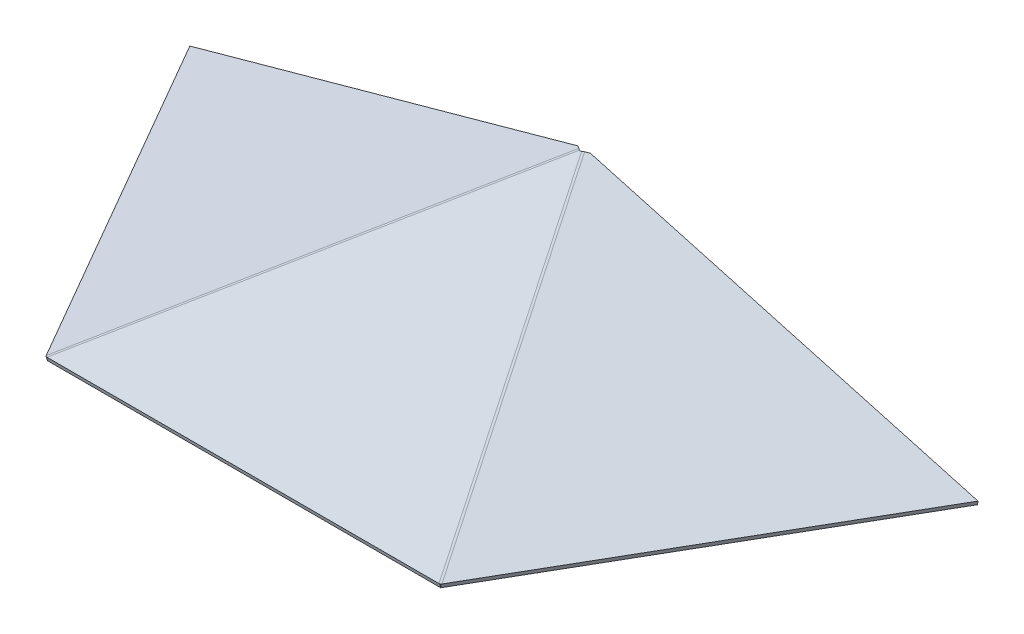
ISO-10303-21;
HEADER;
FILE_DESCRIPTION(('STEP AP214'),'2;1');
FILE_NAME('part.step','',(''),(''),'','','');
FILE_SCHEMA(('AUTOMOTIVE_DESIGN { 1 0 10303 214 1 1 1 1 }'));
ENDSEC;
DATA;
#1=APPLICATION_CONTEXT('core data for automotive mechanical design processes');
#2=APPLICATION_PROTOCOL_DEFINITION('international standard','automotive_design',2000,#1);
#3=PRODUCT_CONTEXT('',#1,'mechanical');
#4=PRODUCT('Part','Part','',(#3));
#5=PRODUCT_RELATED_PRODUCT_CATEGORY('part','',(#4));
#6=PRODUCT_DEFINITION_FORMATION('','',#4);
#7=PRODUCT_DEFINITION_CONTEXT('part definition',#1,'design');
#8=PRODUCT_DEFINITION('design','',#6,#7);
#9=PRODUCT_DEFINITION_SHAPE('','',#8);
#10=(LENGTH_UNIT() NAMED_UNIT(*) SI_UNIT(.MILLI.,.METRE.));
#11=(NAMED_UNIT(*) PLANE_ANGLE_UNIT() SI_UNIT($,.RADIAN.));
#12=(NAMED_UNIT(*) SI_UNIT($,.STERADIAN.) SOLID_ANGLE_UNIT());
#13=UNCERTAINTY_MEASURE_WITH_UNIT(LENGTH_MEASURE(1.E-05),#10,'distance_accuracy_value','');
#14=(GEOMETRIC_REPRESENTATION_CONTEXT(3) GLOBAL_UNCERTAINTY_ASSIGNED_CONTEXT((#13)) GLOBAL_UNIT_ASSIGNED_CONTEXT((#10,
#11,#12)) REPRESENTATION_CONTEXT('',''));
#15=CARTESIAN_POINT('',(0.,0.,0.));
#16=DIRECTION('',(0.,0.,1.));
#17=DIRECTION('',(1.,0.,0.));
#18=AXIS2_PLACEMENT_3D('',#15,#16,#17);
#19=CARTESIAN_POINT('',(-90.6415003255298,-327.07434132935,-58.0414148846411));
#20=DIRECTION('',(0.0406971003413713,0.1468530114833,-0.988320767282612));
#21=DIRECTION('',(0.263943522128751,0.952424147199324,0.152387863551892));
#22=AXIS2_PLACEMENT_3D('',#19,#20,#21);
#23=PLANE('',#22);
#24=DIRECTION('',(-0.963679180614625,0.267062608483341,0.));
#25=VECTOR('',#24,1.);
#26=CARTESIAN_POINT('',(10.2850944810467,37.1131379204565,0.228581795327824));
#27=LINE('',#26,#25);
#28=CARTESIAN_POINT('',(139.050448619764,1.42863622079898,0.228581795327811));
#29=VERTEX_POINT('',#28);
#30=CARTESIAN_POINT('',(2.24965773301819,39.339983473831,0.228581795327811));
#31=VERTEX_POINT('',#30);
#32=EDGE_CURVE('E226',#29,#31,#27,.T.);
#33=ORIENTED_EDGE('',*,*,#32,.F.);
#34=DIRECTION('',(0.263943522128751,0.952424147199324,0.152387863551892));
#35=VECTOR('',#34,1.);
#36=CARTESIAN_POINT('',(38.1238538131879,-362.758843029008,-58.0414148846411));
#37=LINE('',#36,#35);
#38=CARTESIAN_POINT('',(138.654533336571,0.,0.));
#39=VERTEX_POINT('',#38);
#40=EDGE_CURVE('E13',#39,#29,#37,.T.);
#41=ORIENTED_EDGE('',*,*,#40,.F.);
#42=DIRECTION('',(-0.963679180614624,0.267062608483341,0.));
#43=VECTOR('',#42,1.);
#44=CARTESIAN_POINT('',(9.88917919785359,35.6845016996575,0.));
#45=LINE('',#44,#43);
#46=CARTESIAN_POINT('',(1.85374244982505,37.9113472530321,0.));
#47=VERTEX_POINT('',#46);
#48=EDGE_CURVE('E78',#39,#47,#45,.T.);
#49=ORIENTED_EDGE('',*,*,#48,.T.);
#50=DIRECTION('',(0.263943522128751,0.952424147199324,0.152387863551892));
#51=VECTOR('',#50,1.);
#52=CARTESIAN_POINT('',(-98.6769370735583,-324.847495775976,-58.0414148846411));
#53=LINE('',#52,#51);
#54=EDGE_CURVE('E232',#47,#31,#53,.T.);
#55=ORIENTED_EDGE('',*,*,#54,.T.);
#56=EDGE_LOOP('',(#33,#41,#49,#55));
#57=FACE_BOUND('',#56,.T.);
#58=ADVANCED_FACE('F58',(#57),#23,.T.);
#59=CARTESIAN_POINT('',(-95.3192480769532,-325.43762139121,-60.1688177275612));
#60=DIRECTION('',(-0.481839590307312,0.26706260848334,-0.834570651510437));
#61=DIRECTION('',(-0.785581824913315,0.290275761973876,0.54644412191582));
#62=AXIS2_PLACEMENT_3D('',#59,#60,#61);
#63=PLANE('',#62);
#64=DIRECTION('',(-0.835562341383784,0.146853011483301,0.529405106397298));
#65=VECTOR('',#64,1.);
#66=CARTESIAN_POINT('',(5.60734672962338,38.7498578585967,-1.89882104759222));
#67=LINE('',#66,#65);
#68=CARTESIAN_POINT('',(1.02123849805244,39.5558824619545,1.00689764751258));
#69=VERTEX_POINT('',#68);
#70=EDGE_CURVE('E92',#31,#69,#67,.T.);
#71=ORIENTED_EDGE('',*,*,#70,.F.);
#72=ORIENTED_EDGE('',*,*,#54,.F.);
#73=DIRECTION('',(-0.835562341383784,0.146853011483301,0.529405106397298));
#74=VECTOR('',#73,1.);
#75=CARTESIAN_POINT('',(5.21143144643026,37.3212216377977,-2.12740284292005));
#76=LINE('',#75,#74);
#77=CARTESIAN_POINT('',(0.625323214859296,38.1272462411555,0.778315852184755));
#78=VERTEX_POINT('',#77);
#79=EDGE_CURVE('E221',#47,#78,#76,.T.);
#80=ORIENTED_EDGE('',*,*,#79,.T.);
#81=DIRECTION('',(0.263943522128751,0.952424147199324,0.152387863551892));
#82=VECTOR('',#81,1.);
#83=CARTESIAN_POINT('',(-99.9053563085241,-324.631596787852,-57.2630990324564));
#84=LINE('',#83,#82);
#85=EDGE_CURVE('E214',#78,#69,#84,.T.);
#86=ORIENTED_EDGE('',*,*,#85,.T.);
#87=EDGE_LOOP('',(#71,#72,#80,#86));
#88=FACE_BOUND('',#87,.T.);
#89=ADVANCED_FACE('F220',(#88),#63,.T.);
#90=CARTESIAN_POINT('',(10.0554473588905,36.2844702467344,5.80551523947748));
#91=DIRECTION('',(-0.263943522128751,-0.952424147199324,-0.152387863551892));
#92=DIRECTION('',(0.963679180614624,-0.267062608483341,0.));
#93=AXIS2_PLACEMENT_3D('',#90,#91,#92);
#94=PLANE('',#93);
#95=ORIENTED_EDGE('',*,*,#70,.T.);
#96=DIRECTION('',(0.481839590307312,-0.26706260848334,0.834570651510437));
#97=VECTOR('',#96,1.);
#98=CARTESIAN_POINT('',(1.02123849805238,39.5558824619544,1.00689764751253));
#99=LINE('',#98,#97);
#100=CARTESIAN_POINT('',(69.8111631255219,1.42863622079898,120.154542151123));
#101=VERTEX_POINT('',#100);
#102=EDGE_CURVE('E201',#69,#101,#99,.T.);
#103=ORIENTED_EDGE('',*,*,#102,.T.);
#104=DIRECTION('',(0.499999999999998,0.,-0.86602540378444));
#105=VECTOR('',#104,1.);
#106=CARTESIAN_POINT('',(104.386815285622,1.42863622079894,60.2677559050012));
#107=LINE('',#106,#105);
#108=EDGE_CURVE('E208',#101,#29,#107,.T.);
#109=ORIENTED_EDGE('',*,*,#108,.T.);
#110=ORIENTED_EDGE('',*,*,#32,.T.);
#111=EDGE_LOOP('',(#95,#103,#109,#110));
#112=FACE_BOUND('',#111,.T.);
#113=ADVANCED_FACE('F224',(#112),#94,.F.);
#114=CARTESIAN_POINT('',(3.46022047904538,-362.758843029008,1.99775922503227));
#115=DIRECTION('',(0.824823506652345,-0.304775727103784,0.47621207359966));
#116=DIRECTION('',(0.41383501697767,-0.248451741891321,-0.875792390166905));
#117=AXIS2_PLACEMENT_3D('',#114,#115,#116);
#118=PLANE('',#117);
#119=ORIENTED_EDGE('',*,*,#108,.F.);
#120=DIRECTION('',(0.263943522128751,0.952424147199324,0.152387863551892));
#121=VECTOR('',#120,1.);
#122=CARTESIAN_POINT('',(-31.1154316810546,-362.758843029008,61.8845454711544));
#123=LINE('',#122,#121);
#124=CARTESIAN_POINT('',(69.4152478423287,0.,119.925960355795));
#125=VERTEX_POINT('',#124);
#126=EDGE_CURVE('E235',#125,#101,#123,.T.);
#127=ORIENTED_EDGE('',*,*,#126,.F.);
#128=DIRECTION('',(0.499999999999998,0.,-0.86602540378444));
#129=VECTOR('',#128,1.);
#130=CARTESIAN_POINT('',(103.990900002429,0.,60.0391741096734));
#131=LINE('',#130,#129);
#132=EDGE_CURVE('E69',#125,#39,#131,.T.);
#133=ORIENTED_EDGE('',*,*,#132,.T.);
#134=ORIENTED_EDGE('',*,*,#40,.T.);
#135=EDGE_LOOP('',(#119,#127,#133,#134));
#136=FACE_BOUND('',#135,.T.);
#137=ADVANCED_FACE('F252',(#136),#118,.T.);
#138=CARTESIAN_POINT('',(9.65953207569734,34.8558340259354,5.57693344414965));
#139=DIRECTION('',(-0.263943522128751,-0.952424147199324,-0.152387863551892));
#140=DIRECTION('',(0.963679180614624,-0.267062608483341,0.));
#141=AXIS2_PLACEMENT_3D('',#138,#139,#140);
#142=PLANE('',#141);
#143=DIRECTION('',(0.481839590307312,-0.26706260848334,0.834570651510437));
#144=VECTOR('',#143,1.);
#145=CARTESIAN_POINT('',(0.625323214859275,38.1272462411555,0.778315852184692));
#146=LINE('',#145,#144);
#147=EDGE_CURVE('E239',#78,#125,#146,.T.);
#148=ORIENTED_EDGE('',*,*,#147,.F.);
#149=ORIENTED_EDGE('',*,*,#79,.F.);
#150=ORIENTED_EDGE('',*,*,#48,.F.);
#151=ORIENTED_EDGE('',*,*,#132,.F.);
#152=EDGE_LOOP('',(#148,#149,#150,#151));
#153=FACE_BOUND('',#152,.T.);
#154=ADVANCED_FACE('F60',(#153),#142,.T.);
#155=CARTESIAN_POINT('',(90.6415003255299,-327.07434132935,-58.0414148846411));
#156=DIRECTION('',(0.0406971003413715,-0.1468530114833,0.988320767282612));
#157=DIRECTION('',(0.263943522128751,-0.952424147199324,-0.152387863551891));
#158=AXIS2_PLACEMENT_3D('',#155,#156,#157);
#159=PLANE('',#158);
#160=DIRECTION('',(-0.263943522128751,0.952424147199324,0.152387863551891));
#161=VECTOR('',#160,1.);
#162=CARTESIAN_POINT('',(-38.1238538131877,-362.758843029008,-58.0414148846411));
#163=LINE('',#162,#161);
#164=CARTESIAN_POINT('',(-138.654533336571,0.,0.));
#165=VERTEX_POINT('',#164);
#166=CARTESIAN_POINT('',(-139.050448619764,1.42863622079894,0.228581795327811));
#167=VERTEX_POINT('',#166);
#168=EDGE_CURVE('E539',#165,#167,#163,.T.);
#169=ORIENTED_EDGE('',*,*,#168,.T.);
#170=DIRECTION('',(0.963679180614625,0.267062608483341,0.));
#171=VECTOR('',#170,1.);
#172=CARTESIAN_POINT('',(-10.2850944810467,37.1131379204564,0.228581795327824));
#173=LINE('',#172,#171);
#174=CARTESIAN_POINT('',(-2.24965773301817,39.3399834738311,0.228581795327832));
#175=VERTEX_POINT('',#174);
#176=EDGE_CURVE('E540',#167,#175,#173,.T.);
#177=ORIENTED_EDGE('',*,*,#176,.T.);
#178=DIRECTION('',(-0.263943522128751,0.952424147199324,0.152387863551891));
#179=VECTOR('',#178,1.);
#180=CARTESIAN_POINT('',(98.6769370735585,-324.847495775976,-58.0414148846411));
#181=LINE('',#180,#179);
#182=CARTESIAN_POINT('',(-1.853742449825,37.9113472530321,0.));
#183=VERTEX_POINT('',#182);
#184=EDGE_CURVE('E819',#183,#175,#181,.T.);
#185=ORIENTED_EDGE('',*,*,#184,.F.);
#186=DIRECTION('',(0.963679180614624,0.267062608483341,0.));
#187=VECTOR('',#186,1.);
#188=CARTESIAN_POINT('',(-9.88917919785358,35.6845016996575,0.));
#189=LINE('',#188,#187);
#190=EDGE_CURVE('E110',#165,#183,#189,.T.);
#191=ORIENTED_EDGE('',*,*,#190,.F.);
#192=EDGE_LOOP('',(#169,#177,#185,#191));
#193=FACE_BOUND('',#192,.T.);
#194=ADVANCED_FACE('F575',(#193),#159,.F.);
#195=CARTESIAN_POINT('',(-3.46022047904522,-362.758843029008,1.99775922503224));
#196=DIRECTION('',(-0.824823506652346,-0.304775727103784,0.47621207359966));
#197=DIRECTION('',(0.41383501697767,0.24845174189132,0.875792390166905));
#198=AXIS2_PLACEMENT_3D('',#195,#196,#197);
#199=PLANE('',#198);
#200=DIRECTION('',(0.499999999999998,0.,0.86602540378444));
#201=VECTOR('',#200,1.);
#202=CARTESIAN_POINT('',(-104.386815285622,1.42863622079894,60.2677559050011));
#203=LINE('',#202,#201);
#204=CARTESIAN_POINT('',(-69.8111631255217,1.428636220799,120.154542151123));
#205=VERTEX_POINT('',#204);
#206=EDGE_CURVE('E125',#167,#205,#203,.T.);
#207=ORIENTED_EDGE('',*,*,#206,.F.);
#208=ORIENTED_EDGE('',*,*,#168,.F.);
#209=DIRECTION('',(0.499999999999997,0.,0.86602540378444));
#210=VECTOR('',#209,1.);
#211=CARTESIAN_POINT('',(-103.990900002429,0.,60.0391741096733));
#212=LINE('',#211,#210);
#213=CARTESIAN_POINT('',(-69.4152478423286,0.,119.925960355795));
#214=VERTEX_POINT('',#213);
#215=EDGE_CURVE('E521',#165,#214,#212,.T.);
#216=ORIENTED_EDGE('',*,*,#215,.T.);
#217=DIRECTION('',(-0.263943522128751,0.952424147199324,0.152387863551891));
#218=VECTOR('',#217,1.);
#219=CARTESIAN_POINT('',(31.1154316810548,-362.758843029008,61.8845454711545));
#220=LINE('',#219,#218);
#221=EDGE_CURVE('E505',#214,#205,#220,.T.);
#222=ORIENTED_EDGE('',*,*,#221,.T.);
#223=EDGE_LOOP('',(#207,#208,#216,#222));
#224=FACE_BOUND('',#223,.T.);
#225=ADVANCED_FACE('F538',(#224),#199,.T.);
#226=CARTESIAN_POINT('',(-10.0554473588904,36.2844702467344,5.8055152394775));
#227=DIRECTION('',(0.263943522128751,-0.952424147199324,-0.152387863551891));
#228=DIRECTION('',(0.963679180614624,0.267062608483341,0.));
#229=AXIS2_PLACEMENT_3D('',#226,#227,#228);
#230=PLANE('',#229);
#231=ORIENTED_EDGE('',*,*,#206,.T.);
#232=DIRECTION('',(0.481839590307312,0.26706260848334,-0.834570651510438));
#233=VECTOR('',#232,1.);
#234=CARTESIAN_POINT('',(-69.8111631255218,1.42863622079892,120.154542151123));
#235=LINE('',#234,#233);
#236=CARTESIAN_POINT('',(-1.02123849805232,39.5558824619545,1.00689764751255));
#237=VERTEX_POINT('',#236);
#238=EDGE_CURVE('E554',#205,#237,#235,.T.);
#239=ORIENTED_EDGE('',*,*,#238,.T.);
#240=DIRECTION('',(-0.835562341383784,-0.146853011483302,-0.529405106397298));
#241=VECTOR('',#240,1.);
#242=CARTESIAN_POINT('',(-5.60734672962335,38.7498578585967,-1.89882104759224));
#243=LINE('',#242,#241);
#244=EDGE_CURVE('E546',#237,#175,#243,.T.);
#245=ORIENTED_EDGE('',*,*,#244,.T.);
#246=ORIENTED_EDGE('',*,*,#176,.F.);
#247=EDGE_LOOP('',(#231,#239,#245,#246));
#248=FACE_BOUND('',#247,.T.);
#249=ADVANCED_FACE('F574',(#248),#230,.F.);
#250=CARTESIAN_POINT('',(95.3192480769533,-325.43762139121,-60.1688177275611));
#251=DIRECTION('',(0.481839590307312,0.26706260848334,-0.834570651510438));
#252=DIRECTION('',(-0.785581824913315,-0.290275761973876,-0.54644412191582));
#253=AXIS2_PLACEMENT_3D('',#250,#251,#252);
#254=PLANE('',#253);
#255=ORIENTED_EDGE('',*,*,#244,.F.);
#256=DIRECTION('',(-0.263943522128751,0.952424147199324,0.152387863551891));
#257=VECTOR('',#256,1.);
#258=CARTESIAN_POINT('',(99.9053563085243,-324.631596787852,-57.2630990324564));
#259=LINE('',#258,#257);
#260=CARTESIAN_POINT('',(-0.62532321485917,38.1272462411555,0.778315852184653));
#261=VERTEX_POINT('',#260);
#262=EDGE_CURVE('E537',#261,#237,#259,.T.);
#263=ORIENTED_EDGE('',*,*,#262,.F.);
#264=DIRECTION('',(-0.835562341383784,-0.146853011483302,-0.529405106397298));
#265=VECTOR('',#264,1.);
#266=CARTESIAN_POINT('',(-5.21143144643021,37.3212216377977,-2.12740284292008));
#267=LINE('',#266,#265);
#268=EDGE_CURVE('E535',#261,#183,#267,.T.);
#269=ORIENTED_EDGE('',*,*,#268,.T.);
#270=ORIENTED_EDGE('',*,*,#184,.T.);
#271=EDGE_LOOP('',(#255,#263,#269,#270));
#272=FACE_BOUND('',#271,.T.);
#273=ADVANCED_FACE('F578',(#272),#254,.T.);
#274=CARTESIAN_POINT('',(-9.65953207569732,34.8558340259354,5.57693344414966));
#275=DIRECTION('',(0.263943522128751,-0.952424147199324,-0.152387863551891));
#276=DIRECTION('',(0.963679180614624,0.267062608483341,0.));
#277=AXIS2_PLACEMENT_3D('',#274,#275,#276);
#278=PLANE('',#277);
#279=DIRECTION('',(0.481839590307312,0.26706260848334,-0.834570651510438));
#280=VECTOR('',#279,1.);
#281=CARTESIAN_POINT('',(-69.4152478423286,0.,119.925960355796));
#282=LINE('',#281,#280);
#283=EDGE_CURVE('E440',#214,#261,#282,.T.);
#284=ORIENTED_EDGE('',*,*,#283,.F.);
#285=ORIENTED_EDGE('',*,*,#215,.F.);
#286=ORIENTED_EDGE('',*,*,#190,.T.);
#287=ORIENTED_EDGE('',*,*,#268,.F.);
#288=EDGE_LOOP('',(#284,#285,#286,#287));
#289=FACE_BOUND('',#288,.T.);
#290=ADVANCED_FACE('F534',(#289),#278,.T.);
#291=CARTESIAN_POINT('',(-4.44810062926708,-317.908520930581,-110.223987020652));
#292=DIRECTION('',(-0.481839590307312,0.26706260848334,-0.834570651510437));
#293=DIRECTION('',(-0.866025403784439,0.,0.5));
#294=AXIS2_PLACEMENT_3D('',#291,#292,#293);
#295=PLANE('',#294);
#296=DIRECTION('',(-0.876259441725156,-0.1468530114833,0.458915660885313));
#297=VECTOR('',#296,1.);
#298=CARTESIAN_POINT('',(-4.44810062926709,38.7498578585967,3.90669419188531));
#299=LINE('',#298,#297);
#300=CARTESIAN_POINT('',(0.36137969273054,39.5558824619544,1.38786730639224));
#301=VERTEX_POINT('',#300);
#302=CARTESIAN_POINT('',(0.,39.4953185540073,1.57712951872679));
#303=VERTEX_POINT('',#302);
#304=EDGE_CURVE('E140',#301,#303,#299,.T.);
#305=ORIENTED_EDGE('',*,*,#304,.F.);
#306=DIRECTION('',(0.,0.952424147199324,0.304775727103784));
#307=VECTOR('',#306,1.);
#308=CARTESIAN_POINT('',(0.361379692730548,-317.102496327223,-112.742813906145));
#309=LINE('',#308,#307);
#310=CARTESIAN_POINT('',(0.361379692730544,38.1272462411555,0.930703715736583));
#311=VERTEX_POINT('',#310);
#312=EDGE_CURVE('E216',#311,#301,#309,.T.);
#313=ORIENTED_EDGE('',*,*,#312,.F.);
#314=DIRECTION('',(-0.876259441725156,-0.1468530114833,0.458915660885313));
#315=VECTOR('',#314,1.);
#316=CARTESIAN_POINT('',(-4.44810062926709,37.3212216377977,3.44953060122963));
#317=LINE('',#316,#315);
#318=CARTESIAN_POINT('',(0.,38.0666823332084,1.11996592807115));
#319=VERTEX_POINT('',#318);
#320=EDGE_CURVE('E372',#311,#319,#317,.T.);
#321=ORIENTED_EDGE('',*,*,#320,.T.);
#322=DIRECTION('',(0.,0.952424147199324,0.304775727103784));
#323=VECTOR('',#322,1.);
#324=CARTESIAN_POINT('',(0.,-317.16306023517,-112.55355169381));
#325=LINE('',#324,#323);
#326=EDGE_CURVE('E388',#319,#303,#325,.T.);
#327=ORIENTED_EDGE('',*,*,#326,.T.);
#328=EDGE_LOOP('',(#305,#313,#321,#327));
#329=FACE_BOUND('',#328,.T.);
#330=ADVANCED_FACE('F411',(#329),#295,.T.);
#331=CARTESIAN_POINT('',(0.,-355.229742568379,6.4048305974663));
#332=DIRECTION('',(0.,-0.304775727103784,0.952424147199324));
#333=DIRECTION('',(0.,-0.952424147199324,-0.304775727103784));
#334=AXIS2_PLACEMENT_3D('',#331,#332,#333);
#335=PLANE('',#334);
#336=DIRECTION('',(1.,0.,0.));
#337=VECTOR('',#336,1.);
#338=CARTESIAN_POINT('',(0.,1.42863622079897,120.535511810003));
#339=LINE('',#338,#337);
#340=CARTESIAN_POINT('',(-69.1513043201999,1.42863622079895,120.535511810003));
#341=VERTEX_POINT('',#340);
#342=CARTESIAN_POINT('',(69.1513043202001,1.42863622079901,120.535511810003));
#343=VERTEX_POINT('',#342);
#344=EDGE_CURVE('E369',#341,#343,#339,.T.);
#345=ORIENTED_EDGE('',*,*,#344,.F.);
#346=DIRECTION('',(0.,0.952424147199324,0.304775727103784));
#347=VECTOR('',#346,1.);
#348=CARTESIAN_POINT('',(-69.1513043201999,-355.229742568379,6.4048305974663));
#349=LINE('',#348,#347);
#350=CARTESIAN_POINT('',(-69.1513043201999,0.,120.078348219347));
#351=VERTEX_POINT('',#350);
#352=EDGE_CURVE('E383',#351,#341,#349,.T.);
#353=ORIENTED_EDGE('',*,*,#352,.F.);
#354=DIRECTION('',(1.,0.,0.));
#355=VECTOR('',#354,1.);
#356=CARTESIAN_POINT('',(0.,0.,120.078348219347));
#357=LINE('',#356,#355);
#358=CARTESIAN_POINT('',(69.1513043202,0.,120.078348219347));
#359=VERTEX_POINT('',#358);
#360=EDGE_CURVE('E433',#351,#359,#357,.T.);
#361=ORIENTED_EDGE('',*,*,#360,.T.);
#362=DIRECTION('',(0.,0.952424147199324,0.304775727103784));
#363=VECTOR('',#362,1.);
#364=CARTESIAN_POINT('',(69.1513043202,-355.229742568379,6.4048305974663));
#365=LINE('',#364,#363);
#366=EDGE_CURVE('E346',#359,#343,#365,.T.);
#367=ORIENTED_EDGE('',*,*,#366,.T.);
#368=EDGE_LOOP('',(#345,#353,#361,#367));
#369=FACE_BOUND('',#368,.T.);
#370=ADVANCED_FACE('F400',(#369),#335,.T.);
#371=CARTESIAN_POINT('',(4.44810062926711,-317.908520930581,-110.223987020652));
#372=DIRECTION('',(0.481839590307312,0.26706260848334,-0.834570651510437));
#373=DIRECTION('',(-0.866025403784439,0.,-0.5));
#374=AXIS2_PLACEMENT_3D('',#371,#372,#373);
#375=PLANE('',#374);
#376=DIRECTION('',(-0.876259441725156,0.1468530114833,-0.458915660885313));
#377=VECTOR('',#376,1.);
#378=CARTESIAN_POINT('',(4.4481006292671,38.7498578585967,3.90669419188529));
#379=LINE('',#378,#377);
#380=CARTESIAN_POINT('',(-0.361379692730448,39.5558824619545,1.38786730639228));
#381=VERTEX_POINT('',#380);
#382=EDGE_CURVE('E148',#303,#381,#379,.T.);
#383=ORIENTED_EDGE('',*,*,#382,.F.);
#384=ORIENTED_EDGE('',*,*,#326,.F.);
#385=DIRECTION('',(-0.876259441725156,0.1468530114833,-0.458915660885313));
#386=VECTOR('',#385,1.);
#387=CARTESIAN_POINT('',(4.4481006292671,37.3212216377977,3.44953060122961));
#388=LINE('',#387,#386);
#389=CARTESIAN_POINT('',(-0.361379692730373,38.1272462411555,0.930703715736429));
#390=VERTEX_POINT('',#389);
#391=EDGE_CURVE('E368',#319,#390,#388,.T.);
#392=ORIENTED_EDGE('',*,*,#391,.T.);
#393=DIRECTION('',(0.,0.952424147199324,0.304775727103784));
#394=VECTOR('',#393,1.);
#395=CARTESIAN_POINT('',(-0.361379692730437,-317.102496327223,-112.742813906145));
#396=LINE('',#395,#394);
#397=EDGE_CURVE('E427',#390,#381,#396,.T.);
#398=ORIENTED_EDGE('',*,*,#397,.T.);
#399=EDGE_LOOP('',(#383,#384,#392,#398));
#400=FACE_BOUND('',#399,.T.);
#401=ADVANCED_FACE('F410',(#400),#375,.T.);
#402=CARTESIAN_POINT('',(0.,34.8558340259354,11.1538668882993));
#403=DIRECTION('',(0.,-0.952424147199324,-0.304775727103784));
#404=DIRECTION('',(0.,0.304775727103784,-0.952424147199324));
#405=AXIS2_PLACEMENT_3D('',#402,#403,#404);
#406=PLANE('',#405);
#407=ORIENTED_EDGE('',*,*,#320,.F.);
#408=DIRECTION('',(0.481839590307312,-0.26706260848334,0.834570651510438));
#409=VECTOR('',#408,1.);
#410=CARTESIAN_POINT('',(0.361379692730539,38.1272462411555,0.930703715736572));
#411=LINE('',#410,#409);
#412=EDGE_CURVE('E386',#311,#359,#411,.T.);
#413=ORIENTED_EDGE('',*,*,#412,.T.);
#414=ORIENTED_EDGE('',*,*,#360,.F.);
#415=DIRECTION('',(0.481839590307312,0.26706260848334,-0.834570651510438));
#416=VECTOR('',#415,1.);
#417=CARTESIAN_POINT('',(-69.1513043201999,0.,120.078348219348));
#418=LINE('',#417,#416);
#419=EDGE_CURVE('E389',#351,#390,#418,.T.);
#420=ORIENTED_EDGE('',*,*,#419,.T.);
#421=ORIENTED_EDGE('',*,*,#391,.F.);
#422=EDGE_LOOP('',(#407,#413,#414,#420,#421));
#423=FACE_BOUND('',#422,.T.);
#424=ADVANCED_FACE('F603',(#423),#406,.T.);
#425=CARTESIAN_POINT('',(0.,36.2844702467344,11.611030478955));
#426=DIRECTION('',(0.,-0.952424147199324,-0.304775727103784));
#427=DIRECTION('',(0.,0.304775727103784,-0.952424147199324));
#428=AXIS2_PLACEMENT_3D('',#425,#426,#427);
#429=PLANE('',#428);
#430=DIRECTION('',(0.481839590307312,-0.26706260848334,0.834570651510438));
#431=VECTOR('',#430,1.);
#432=CARTESIAN_POINT('',(0.361379692730539,39.5558824619544,1.38786730639223));
#433=LINE('',#432,#431);
#434=EDGE_CURVE('E365',#301,#343,#433,.T.);
#435=ORIENTED_EDGE('',*,*,#434,.F.);
#436=ORIENTED_EDGE('',*,*,#304,.T.);
#437=ORIENTED_EDGE('',*,*,#382,.T.);
#438=DIRECTION('',(0.481839590307312,0.26706260848334,-0.834570651510438));
#439=VECTOR('',#438,1.);
#440=CARTESIAN_POINT('',(-69.1513043201999,1.42863622079897,120.535511810003));
#441=LINE('',#440,#439);
#442=EDGE_CURVE('E374',#341,#381,#441,.T.);
#443=ORIENTED_EDGE('',*,*,#442,.F.);
#444=ORIENTED_EDGE('',*,*,#344,.T.);
#445=EDGE_LOOP('',(#435,#436,#437,#443,#444));
#446=FACE_BOUND('',#445,.T.);
#447=ADVANCED_FACE('F708',(#446),#429,.F.);
#448=CARTESIAN_POINT('',(-0.361379692730424,37.1748220939561,0.625927988632757));
#449=DIRECTION('',(0.481839590307318,0.267062608483339,-0.834570651510434));
#450=DIRECTION('',(-0.866025403784435,0.,-0.500000000000006));
#451=AXIS2_PLACEMENT_3D('',#448,#449,#450);
#452=PLANE('',#451);
#453=ORIENTED_EDGE('',*,*,#397,.F.);
#454=CARTESIAN_POINT('',(-0.361379692730368,37.1748220939562,0.625927988632646));
#455=DIRECTION('',(0.481839590307312,0.26706260848334,-0.834570651510438));
#456=DIRECTION('',(-0.866025403784439,0.,-0.499999999999999));
#457=AXIS2_PLACEMENT_3D('',#454,#455,#456);
#458=CIRCLE('',#457,1.00000000000001);
#459=EDGE_CURVE('E532',#390,#261,#458,.F.);
#460=ORIENTED_EDGE('',*,*,#459,.T.);
#461=ORIENTED_EDGE('',*,*,#262,.T.);
#462=CARTESIAN_POINT('',(-0.361379692730368,37.1748220939562,0.625927988632646));
#463=DIRECTION('',(0.481839590307312,0.26706260848334,-0.834570651510438));
#464=DIRECTION('',(-0.866025403784439,0.,-0.499999999999999));
#465=AXIS2_PLACEMENT_3D('',#462,#463,#464);
#466=CIRCLE('',#465,2.50000000000001);
#467=EDGE_CURVE('E132',#381,#237,#466,.F.);
#468=ORIENTED_EDGE('',*,*,#467,.F.);
#469=EDGE_LOOP('',(#453,#460,#461,#468));
#470=FACE_BOUND('',#469,.T.);
#471=ADVANCED_FACE('F714',(#470),#452,.T.);
#472=CARTESIAN_POINT('',(-69.8111631255217,1.42863622079898,120.154542151123));
#473=CARTESIAN_POINT('',(-69.7282837092607,1.43425283742235,120.262989657093));
#474=CARTESIAN_POINT('',(-69.6428299449391,1.43056348513933,120.369943048303));
#475=CARTESIAN_POINT('',(-69.5560668416055,1.41745804635144,120.474641744318));
#476=CARTESIAN_POINT('',(-69.4152478423286,0.,119.925960355796));
#477=CARTESIAN_POINT('',(-69.3962832362947,-0.00561658498654571,119.993911673158));
#478=CARTESIAN_POINT('',(-69.3762879573557,-0.0149553596019049,120.06126543747));
#479=CARTESIAN_POINT('',(-69.355769885243,-0.0280607245704963,120.127717239297));
#480=B_SPLINE_SURFACE_WITH_KNOTS('',1,3,((#472,#473,#474,#475),(#476,#477,#478,#479)),
.UNSPECIFIED.,.F.,.F.,.F.,(2,2),(4,4),(0.,1.),(0.,1.),.UNSPECIFIED.);
#481=CARTESIAN_POINT('',(-69.4152478423286,0.,119.925960355796));
#482=CARTESIAN_POINT('',(-69.3962832362947,-0.00561658498654571,119.993911673158));
#483=CARTESIAN_POINT('',(-69.3762879573557,-0.0149553596019049,120.06126543747));
#484=CARTESIAN_POINT('',(-69.355769885243,-0.0280607245704963,120.127717239297));
#485=B_SPLINE_CURVE_WITH_KNOTS('',3,(#481,#482,#483,#484),.UNSPECIFIED.,.F.,.F.,(4,4),(0.,1.),.UNSPECIFIED.);
#486=CARTESIAN_POINT('',(-69.355769885243,-0.0280607245704825,120.127717239297));
#487=VERTEX_POINT('',#486);
#488=EDGE_CURVE('E514',#214,#487,#485,.T.);
#489=CARTESIAN_POINT('',(-69.355769885243,-0.0280607245704963,120.127717239297));
#490=CARTESIAN_POINT('',(-69.5560668416055,1.41745804635144,120.474641744318));
#491=B_SPLINE_CURVE_WITH_KNOTS('',1,(#489,#490),.UNSPECIFIED.,.F.,.F.,(2,2),(0.,1.),.UNSPECIFIED.);
#492=CARTESIAN_POINT('',(-69.5560672836203,1.41745811311705,120.47464121093));
#493=VERTEX_POINT('',#492);
#494=EDGE_CURVE('E447',#487,#493,#491,.T.);
#495=CARTESIAN_POINT('',(-69.5560668416055,1.41745804635144,120.474641744318));
#496=CARTESIAN_POINT('',(-69.6428299449391,1.43056348513933,120.369943048303));
#497=CARTESIAN_POINT('',(-69.7282837092607,1.43425283742235,120.262989657093));
#498=CARTESIAN_POINT('',(-69.8111631255217,1.42863622079898,120.154542151123));
#499=B_SPLINE_CURVE_WITH_KNOTS('',3,(#495,#496,#497,#498),.UNSPECIFIED.,.F.,.F.,(4,4),(0.,1.),.UNSPECIFIED.);
#500=EDGE_CURVE('E517',#205,#493,#499,.F.);
#501=ORIENTED_EDGE('',*,*,#221,.F.);
#502=ORIENTED_EDGE('',*,*,#488,.T.);
#503=ORIENTED_EDGE('',*,*,#494,.T.);
#504=ORIENTED_EDGE('',*,*,#500,.F.);
#505=EDGE_LOOP('',(#501,#502,#503,#504));
#506=FACE_BOUND('',#505,.T.);
#507=ADVANCED_FACE('F466',(#506),#480,.T.);
#508=CARTESIAN_POINT('',(-69.5560668416055,1.41745804635144,120.474641744318));
#509=CARTESIAN_POINT('',(-69.4220135594466,1.43056348513932,120.497431447909));
#510=CARTESIAN_POINT('',(-69.2866623234773,1.43425283742233,120.517959883055));
#511=CARTESIAN_POINT('',(-69.1513043201999,1.42863622079895,120.535511810003));
#512=CARTESIAN_POINT('',(-69.355769885243,-0.0280607245704963,120.127717239297));
#513=CARTESIAN_POINT('',(-69.2879619006778,-0.0149553596019455,120.11226051007));
#514=CARTESIAN_POINT('',(-69.2196341902729,-0.00561658498655543,120.09590004743));
#515=CARTESIAN_POINT('',(-69.1513043201999,0.,120.078348219347));
#516=B_SPLINE_SURFACE_WITH_KNOTS('',1,3,((#508,#509,#510,#511),(#512,#513,#514,#515)),
.UNSPECIFIED.,.F.,.F.,.F.,(2,2),(4,4),(0.,1.),(0.,1.),.UNSPECIFIED.);
#517=CARTESIAN_POINT('',(-69.355769885243,-0.0280607245704963,120.127717239297));
#518=CARTESIAN_POINT('',(-69.2879619006778,-0.0149553596019455,120.11226051007));
#519=CARTESIAN_POINT('',(-69.2196341902729,-0.00561658498655543,120.09590004743));
#520=CARTESIAN_POINT('',(-69.1513043201999,0.,120.078348219347));
#521=B_SPLINE_CURVE_WITH_KNOTS('',3,(#517,#518,#519,#520),.UNSPECIFIED.,.F.,.F.,(4,4),(0.,1.),.UNSPECIFIED.);
#522=EDGE_CURVE('E530',#487,#351,#521,.T.);
#523=CARTESIAN_POINT('',(-69.1513043201999,1.42863622079895,120.535511810003));
#524=CARTESIAN_POINT('',(-69.2866623234773,1.43425283742233,120.517959883055));
#525=CARTESIAN_POINT('',(-69.4220135594466,1.43056348513932,120.497431447909));
#526=CARTESIAN_POINT('',(-69.5560668416055,1.41745804635144,120.474641744318));
#527=B_SPLINE_CURVE_WITH_KNOTS('',3,(#523,#524,#525,#526),.UNSPECIFIED.,.F.,.F.,(4,4),(0.,1.),.UNSPECIFIED.);
#528=EDGE_CURVE('E607',#493,#341,#527,.F.);
#529=ORIENTED_EDGE('',*,*,#494,.F.);
#530=ORIENTED_EDGE('',*,*,#522,.T.);
#531=ORIENTED_EDGE('',*,*,#352,.T.);
#532=ORIENTED_EDGE('',*,*,#528,.F.);
#533=EDGE_LOOP('',(#529,#530,#531,#532));
#534=FACE_BOUND('',#533,.T.);
#535=ADVANCED_FACE('F453',(#534),#516,.T.);
#536=CARTESIAN_POINT('',(-220.666208861946,-84.9305082336803,382.205085262497));
#537=DIRECTION('',(0.481839590307312,0.26706260848334,-0.834570651510438));
#538=DIRECTION('',(-0.866025403784439,0.,-0.499999999999999));
#539=AXIS2_PLACEMENT_3D('',#536,#537,#538);
#540=CYLINDRICAL_SURFACE('',#539,2.50000000000001);
#541=ORIENTED_EDGE('',*,*,#528,.T.);
#542=ORIENTED_EDGE('',*,*,#442,.T.);
#543=ORIENTED_EDGE('',*,*,#467,.T.);
#544=ORIENTED_EDGE('',*,*,#238,.F.);
#545=ORIENTED_EDGE('',*,*,#500,.T.);
#546=EDGE_LOOP('',(#541,#542,#543,#544,#545));
#547=FACE_BOUND('',#546,.T.);
#548=ADVANCED_FACE('F465',(#547),#540,.T.);
#549=CARTESIAN_POINT('',(-220.666208861946,-84.9305082336803,382.205085262497));
#550=DIRECTION('',(0.481839590307312,0.26706260848334,-0.834570651510438));
#551=DIRECTION('',(-0.866025403784439,0.,-0.499999999999999));
#552=AXIS2_PLACEMENT_3D('',#549,#550,#551);
#553=CYLINDRICAL_SURFACE('',#552,1.00000000000001);
#554=ORIENTED_EDGE('',*,*,#522,.F.);
#555=ORIENTED_EDGE('',*,*,#488,.F.);
#556=ORIENTED_EDGE('',*,*,#283,.T.);
#557=ORIENTED_EDGE('',*,*,#459,.F.);
#558=ORIENTED_EDGE('',*,*,#419,.F.);
#559=EDGE_LOOP('',(#554,#555,#556,#557,#558));
#560=FACE_BOUND('',#559,.T.);
#561=ADVANCED_FACE('F468',(#560),#553,.F.);
#562=CARTESIAN_POINT('',(69.1513043202001,1.42863622079901,120.535511810003));
#563=CARTESIAN_POINT('',(69.2866623234775,1.43425283742239,120.517959883055));
#564=CARTESIAN_POINT('',(69.4220135594469,1.43056348513937,120.497431447909));
#565=CARTESIAN_POINT('',(69.5560668416057,1.41745804635148,120.474641744318));
#566=CARTESIAN_POINT('',(69.1513043202,0.,120.078348219348));
#567=CARTESIAN_POINT('',(69.2196341902733,-0.0056165849865269,120.09590004743));
#568=CARTESIAN_POINT('',(69.2879619006777,-0.0149553596018585,120.11226051007));
#569=CARTESIAN_POINT('',(69.3557698852432,-0.0280607245704564,120.127717239297));
#570=B_SPLINE_SURFACE_WITH_KNOTS('',1,3,((#562,#563,#564,#565),(#566,#567,#568,#569)),
.UNSPECIFIED.,.F.,.F.,.F.,(2,2),(4,4),(0.,1.),(0.,1.),.UNSPECIFIED.);
#571=CARTESIAN_POINT('',(69.1513043202,0.,120.078348219348));
#572=CARTESIAN_POINT('',(69.2196341902733,-0.0056165849865269,120.09590004743));
#573=CARTESIAN_POINT('',(69.2879619006777,-0.0149553596018585,120.11226051007));
#574=CARTESIAN_POINT('',(69.3557698852432,-0.0280607245704564,120.127717239297));
#575=B_SPLINE_CURVE_WITH_KNOTS('',3,(#571,#572,#573,#574),.UNSPECIFIED.,.F.,.F.,(4,4),(0.,1.),.UNSPECIFIED.);
#576=CARTESIAN_POINT('',(69.3557698852432,-0.0280607245704424,120.127717239297));
#577=VERTEX_POINT('',#576);
#578=EDGE_CURVE('E217',#359,#577,#575,.T.);
#579=CARTESIAN_POINT('',(69.3557698852432,-0.0280607245704564,120.127717239297));
#580=CARTESIAN_POINT('',(69.5560668416057,1.41745804635148,120.474641744318));
#581=B_SPLINE_CURVE_WITH_KNOTS('',1,(#579,#580),.UNSPECIFIED.,.F.,.F.,(2,2),(0.,1.),.UNSPECIFIED.);
#582=CARTESIAN_POINT('',(69.556066158671,1.41745811311709,120.47464186042));
#583=VERTEX_POINT('',#582);
#584=EDGE_CURVE('E345',#577,#583,#581,.T.);
#585=CARTESIAN_POINT('',(69.5560668416057,1.41745804635148,120.474641744318));
#586=CARTESIAN_POINT('',(69.4220135594469,1.43056348513937,120.497431447909));
#587=CARTESIAN_POINT('',(69.2866623234775,1.43425283742239,120.517959883055));
#588=CARTESIAN_POINT('',(69.1513043202001,1.42863622079901,120.535511810003));
#589=B_SPLINE_CURVE_WITH_KNOTS('',3,(#585,#586,#587,#588),.UNSPECIFIED.,.F.,.F.,(4,4),(0.,1.),.UNSPECIFIED.);
#590=EDGE_CURVE('E313',#343,#583,#589,.F.);
#591=ORIENTED_EDGE('',*,*,#366,.F.);
#592=ORIENTED_EDGE('',*,*,#578,.T.);
#593=ORIENTED_EDGE('',*,*,#584,.T.);
#594=ORIENTED_EDGE('',*,*,#590,.F.);
#595=EDGE_LOOP('',(#591,#592,#593,#594));
#596=FACE_BOUND('',#595,.T.);
#597=ADVANCED_FACE('F283',(#596),#570,.T.);
#598=CARTESIAN_POINT('',(69.5560668416057,1.41745804635148,120.474641744318));
#599=CARTESIAN_POINT('',(69.6428299449394,1.43056348513937,120.369943048303));
#600=CARTESIAN_POINT('',(69.7282837092609,1.43425283742238,120.262989657093));
#601=CARTESIAN_POINT('',(69.8111631255219,1.428636220799,120.154542151123));
#602=CARTESIAN_POINT('',(69.3557698852432,-0.0280607245704564,120.127717239297));
#603=CARTESIAN_POINT('',(69.3762879573558,-0.0149553596019009,120.06126543747));
#604=CARTESIAN_POINT('',(69.3962832362949,-0.00561658498649899,119.993911673157));
#605=CARTESIAN_POINT('',(69.4152478423288,0.,119.925960355796));
#606=B_SPLINE_SURFACE_WITH_KNOTS('',1,3,((#598,#599,#600,#601),(#602,#603,#604,#605)),
.UNSPECIFIED.,.F.,.F.,.F.,(2,2),(4,4),(0.,1.),(0.,1.),.UNSPECIFIED.);
#607=CARTESIAN_POINT('',(69.3557698852432,-0.0280607245704564,120.127717239297));
#608=CARTESIAN_POINT('',(69.3762879573558,-0.0149553596019009,120.06126543747));
#609=CARTESIAN_POINT('',(69.3962832362949,-0.00561658498649899,119.993911673157));
#610=CARTESIAN_POINT('',(69.4152478423288,0.,119.925960355796));
#611=B_SPLINE_CURVE_WITH_KNOTS('',3,(#607,#608,#609,#610),.UNSPECIFIED.,.F.,.F.,(4,4),(0.,1.),.UNSPECIFIED.);
#612=EDGE_CURVE('E260',#577,#125,#611,.T.);
#613=CARTESIAN_POINT('',(69.8111631255219,1.428636220799,120.154542151123));
#614=CARTESIAN_POINT('',(69.7282837092609,1.43425283742238,120.262989657093));
#615=CARTESIAN_POINT('',(69.6428299449394,1.43056348513937,120.369943048303));
#616=CARTESIAN_POINT('',(69.5560668416057,1.41745804635148,120.474641744318));
#617=B_SPLINE_CURVE_WITH_KNOTS('',3,(#613,#614,#615,#616),.UNSPECIFIED.,.F.,.F.,(4,4),(0.,1.),.UNSPECIFIED.);
#618=EDGE_CURVE('E100',#583,#101,#617,.F.);
#619=ORIENTED_EDGE('',*,*,#584,.F.);
#620=ORIENTED_EDGE('',*,*,#612,.T.);
#621=ORIENTED_EDGE('',*,*,#126,.T.);
#622=ORIENTED_EDGE('',*,*,#618,.F.);
#623=EDGE_LOOP('',(#619,#620,#621,#622));
#624=FACE_BOUND('',#623,.T.);
#625=ADVANCED_FACE('F257',(#624),#606,.T.);
#626=CARTESIAN_POINT('',(0.36137969273059,37.1748220939561,0.625927988632924));
#627=DIRECTION('',(-0.481839590307315,0.26706260848334,-0.834570651510436));
#628=DIRECTION('',(-0.866025403784437,0.,0.500000000000003));
#629=AXIS2_PLACEMENT_3D('',#626,#627,#628);
#630=PLANE('',#629);
#631=ORIENTED_EDGE('',*,*,#85,.F.);
#632=CARTESIAN_POINT('',(0.361379692730535,37.1748220939562,0.625927988632868));
#633=DIRECTION('',(0.481839590307312,-0.26706260848334,0.834570651510438));
#634=DIRECTION('',(0.866025403784439,0.,-0.499999999999999));
#635=AXIS2_PLACEMENT_3D('',#632,#633,#634);
#636=CIRCLE('',#635,1.);
#637=EDGE_CURVE('E335',#78,#311,#636,.T.);
#638=ORIENTED_EDGE('',*,*,#637,.T.);
#639=ORIENTED_EDGE('',*,*,#312,.T.);
#640=CARTESIAN_POINT('',(0.361379692730535,37.1748220939562,0.625927988632868));
#641=DIRECTION('',(0.481839590307312,-0.26706260848334,0.834570651510438));
#642=DIRECTION('',(0.866025403784439,0.,-0.499999999999999));
#643=AXIS2_PLACEMENT_3D('',#640,#641,#642);
#644=CIRCLE('',#643,2.50000000000001);
#645=EDGE_CURVE('E205',#69,#301,#644,.T.);
#646=ORIENTED_EDGE('',*,*,#645,.F.);
#647=EDGE_LOOP('',(#631,#638,#639,#646));
#648=FACE_BOUND('',#647,.T.);
#649=ADVANCED_FACE('F212',(#648),#630,.T.);
#650=CARTESIAN_POINT('',(-149.052298543899,119.988288350466,-258.166154062959));
#651=DIRECTION('',(0.481839590307312,-0.26706260848334,0.834570651510438));
#652=DIRECTION('',(0.866025403784439,0.,-0.499999999999999));
#653=AXIS2_PLACEMENT_3D('',#650,#651,#652);
#654=CYLINDRICAL_SURFACE('',#653,2.50000000000001);
#655=ORIENTED_EDGE('',*,*,#645,.T.);
#656=ORIENTED_EDGE('',*,*,#434,.T.);
#657=ORIENTED_EDGE('',*,*,#590,.T.);
#658=ORIENTED_EDGE('',*,*,#618,.T.);
#659=ORIENTED_EDGE('',*,*,#102,.F.);
#660=EDGE_LOOP('',(#655,#656,#657,#658,#659));
#661=FACE_BOUND('',#660,.T.);
#662=ADVANCED_FACE('F203',(#661),#654,.T.);
#663=CARTESIAN_POINT('',(-149.052298543899,119.988288350466,-258.166154062959));
#664=DIRECTION('',(0.481839590307312,-0.26706260848334,0.834570651510438));
#665=DIRECTION('',(0.866025403784439,0.,-0.499999999999999));
#666=AXIS2_PLACEMENT_3D('',#663,#664,#665);
#667=CYLINDRICAL_SURFACE('',#666,1.);
#668=ORIENTED_EDGE('',*,*,#637,.F.);
#669=ORIENTED_EDGE('',*,*,#147,.T.);
#670=ORIENTED_EDGE('',*,*,#612,.F.);
#671=ORIENTED_EDGE('',*,*,#578,.F.);
#672=ORIENTED_EDGE('',*,*,#412,.F.);
#673=EDGE_LOOP('',(#668,#669,#670,#671,#672));
#674=FACE_BOUND('',#673,.T.);
#675=ADVANCED_FACE('F329',(#674),#667,.F.);
#676=CLOSED_SHELL('',(#58,#89,#113,#137,#154,#194,#225,#249,#273,#290,#330,#370,#401,#424,#447,
#471,#507,#535,#548,#561,#597,#625,#649,#662,#675));
#677=MANIFOLD_SOLID_BREP('B2',#676);
#678=ADVANCED_BREP_SHAPE_REPRESENTATION('',(#18,#677),#14);
#679=SHAPE_DEFINITION_REPRESENTATION(#9,#678);
ENDSEC;
END-ISO-10303-21;
